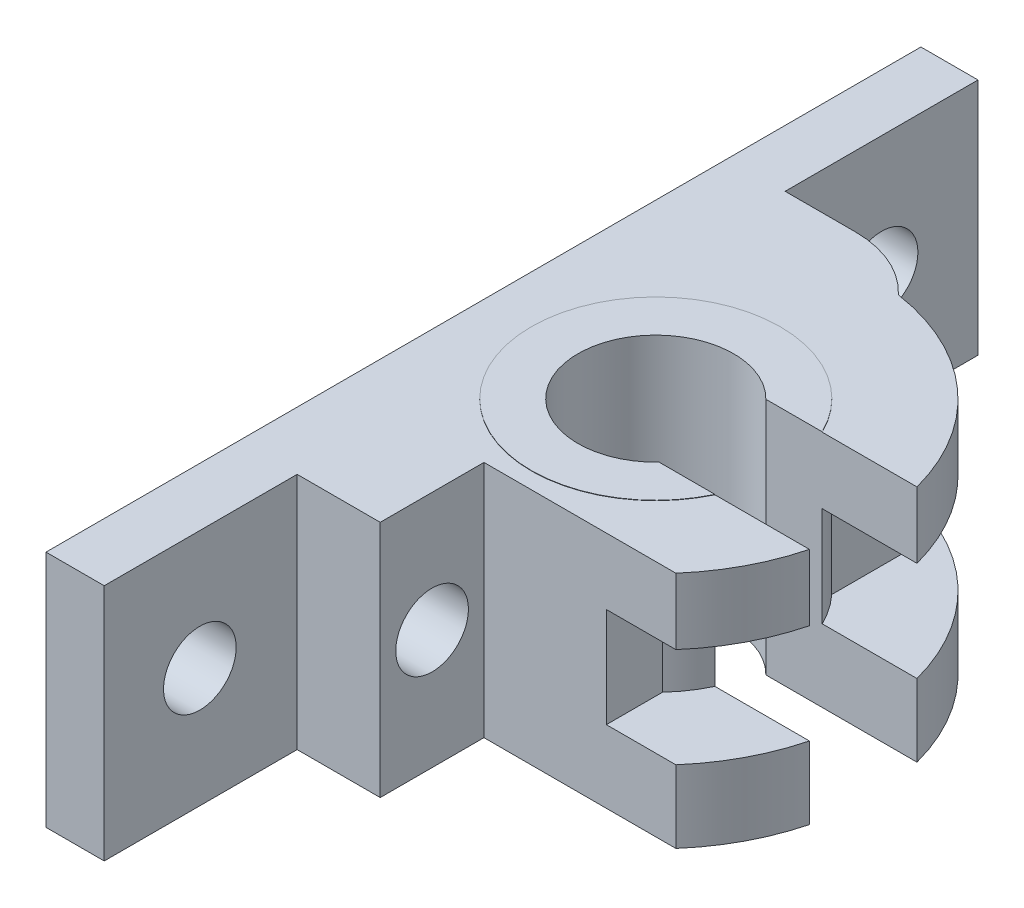
ISO-10303-21;
HEADER;
FILE_DESCRIPTION(('STEP AP214'),'2;1');
FILE_NAME('part.step','',(''),(''),'','','');
FILE_SCHEMA(('AUTOMOTIVE_DESIGN { 1 0 10303 214 1 1 1 1 }'));
ENDSEC;
DATA;
#1=APPLICATION_CONTEXT('core data for automotive mechanical design processes');
#2=APPLICATION_PROTOCOL_DEFINITION('international standard','automotive_design',2000,#1);
#3=PRODUCT_CONTEXT('',#1,'mechanical');
#4=PRODUCT('Part','Part','',(#3));
#5=PRODUCT_RELATED_PRODUCT_CATEGORY('part','',(#4));
#6=PRODUCT_DEFINITION_FORMATION('','',#4);
#7=PRODUCT_DEFINITION_CONTEXT('part definition',#1,'design');
#8=PRODUCT_DEFINITION('design','',#6,#7);
#9=PRODUCT_DEFINITION_SHAPE('','',#8);
#10=(LENGTH_UNIT() NAMED_UNIT(*) SI_UNIT(.MILLI.,.METRE.));
#11=(NAMED_UNIT(*) PLANE_ANGLE_UNIT() SI_UNIT($,.RADIAN.));
#12=(NAMED_UNIT(*) SI_UNIT($,.STERADIAN.) SOLID_ANGLE_UNIT());
#13=UNCERTAINTY_MEASURE_WITH_UNIT(LENGTH_MEASURE(1.E-05),#10,'distance_accuracy_value','');
#14=(GEOMETRIC_REPRESENTATION_CONTEXT(3) GLOBAL_UNCERTAINTY_ASSIGNED_CONTEXT((#13)) GLOBAL_UNIT_ASSIGNED_CONTEXT((#10,
#11,#12)) REPRESENTATION_CONTEXT('',''));
#15=CARTESIAN_POINT('',(0.,0.,0.));
#16=DIRECTION('',(0.,0.,1.));
#17=DIRECTION('',(1.,0.,0.));
#18=AXIS2_PLACEMENT_3D('',#15,#16,#17);
#19=CARTESIAN_POINT('',(0.,11.215,0.));
#20=DIRECTION('',(0.,-1.,0.));
#21=DIRECTION('',(0.,0.,-1.));
#22=AXIS2_PLACEMENT_3D('',#19,#20,#21);
#23=CYLINDRICAL_SURFACE('',#22,11.995);
#24=DIRECTION('',(0.,-1.,0.));
#25=VECTOR('',#24,1.);
#26=CARTESIAN_POINT('',(10.7851270090818,11.215,-5.24986289325488));
#27=LINE('',#26,#25);
#28=CARTESIAN_POINT('',(10.7851270090818,-4.80402203282775,-5.24986289325488));
#29=VERTEX_POINT('',#28);
#30=CARTESIAN_POINT('',(10.7851270090818,4.80402203282774,-5.24986289325488));
#31=VERTEX_POINT('',#30);
#32=EDGE_CURVE('E513',#29,#31,#27,.F.);
#33=ORIENTED_EDGE('',*,*,#32,.F.);
#34=CARTESIAN_POINT('',(0.,-4.80402203282775,0.));
#35=DIRECTION('',(0.,-1.,0.));
#36=DIRECTION('',(0.,0.,-1.));
#37=AXIS2_PLACEMENT_3D('',#34,#35,#36);
#38=CIRCLE('',#37,11.995);
#39=CARTESIAN_POINT('',(8.80000000000003,-4.80402203282775,-8.15107508246609));
#40=VERTEX_POINT('',#39);
#41=EDGE_CURVE('E516',#40,#29,#38,.T.);
#42=ORIENTED_EDGE('',*,*,#41,.F.);
#43=DIRECTION('',(0.,-1.,0.));
#44=VECTOR('',#43,1.);
#45=CARTESIAN_POINT('',(8.80000000000003,11.215,-8.15107508246609));
#46=LINE('',#45,#44);
#47=CARTESIAN_POINT('',(8.80000000000003,4.80402203282774,-8.15107508246609));
#48=VERTEX_POINT('',#47);
#49=EDGE_CURVE('E501',#40,#48,#46,.F.);
#50=ORIENTED_EDGE('',*,*,#49,.T.);
#51=CARTESIAN_POINT('',(0.,4.80402203282774,0.));
#52=DIRECTION('',(0.,1.,0.));
#53=DIRECTION('',(0.,0.,1.));
#54=AXIS2_PLACEMENT_3D('',#51,#52,#53);
#55=CIRCLE('',#54,11.995);
#56=EDGE_CURVE('E497',#31,#48,#55,.T.);
#57=ORIENTED_EDGE('',*,*,#56,.F.);
#58=EDGE_LOOP('',(#33,#42,#50,#57));
#59=FACE_BOUND('',#58,.T.);
#60=ADVANCED_FACE('F61',(#59),#23,.T.);
#61=CARTESIAN_POINT('',(10.7851270090818,11.1805911601393,-5.24986289325488));
#62=VERTEX_POINT('',#61);
#63=CARTESIAN_POINT('',(10.7851270090818,11.215,-5.24986289325488));
#64=VERTEX_POINT('',#63);
#65=EDGE_CURVE('E496',#62,#64,#27,.F.);
#66=ORIENTED_EDGE('',*,*,#65,.F.);
#67=CARTESIAN_POINT('',(0.,11.1805911601393,0.));
#68=DIRECTION('',(0.,-1.,0.));
#69=DIRECTION('',(0.,0.,-1.));
#70=AXIS2_PLACEMENT_3D('',#67,#68,#69);
#71=CIRCLE('',#70,11.995);
#72=CARTESIAN_POINT('',(10.8378510565454,11.1805911601393,5.14013710674512));
#73=VERTEX_POINT('',#72);
#74=EDGE_CURVE('E470',#73,#62,#71,.T.);
#75=ORIENTED_EDGE('',*,*,#74,.F.);
#76=DIRECTION('',(0.,-1.,0.));
#77=VECTOR('',#76,1.);
#78=CARTESIAN_POINT('',(10.8378510565454,11.215,5.14013710674512));
#79=LINE('',#78,#77);
#80=CARTESIAN_POINT('',(10.8378510565454,11.215,5.14013710674512));
#81=VERTEX_POINT('',#80);
#82=EDGE_CURVE('E487',#81,#73,#79,.T.);
#83=ORIENTED_EDGE('',*,*,#82,.F.);
#84=CARTESIAN_POINT('',(0.,11.215,0.));
#85=DIRECTION('',(0.,-1.,0.));
#86=DIRECTION('',(1.,0.,0.));
#87=AXIS2_PLACEMENT_3D('',#84,#85,#86);
#88=CIRCLE('',#87,11.995);
#89=EDGE_CURVE('E514',#81,#64,#88,.T.);
#90=ORIENTED_EDGE('',*,*,#89,.T.);
#91=EDGE_LOOP('',(#66,#75,#83,#90));
#92=FACE_BOUND('',#91,.T.);
#93=ADVANCED_FACE('F495',(#92),#23,.T.);
#94=CARTESIAN_POINT('',(0.,-55.2,0.));
#95=DIRECTION('',(0.,1.,0.));
#96=DIRECTION('',(0.,0.,1.));
#97=AXIS2_PLACEMENT_3D('',#94,#95,#96);
#98=CYLINDRICAL_SURFACE('',#97,20.59);
#99=CARTESIAN_POINT('',(0.,4.80402203282774,0.));
#100=DIRECTION('',(0.,1.,0.));
#101=DIRECTION('',(0.,0.,1.));
#102=AXIS2_PLACEMENT_3D('',#99,#100,#101);
#103=CIRCLE('',#102,20.59);
#104=CARTESIAN_POINT('',(15.4936543015627,4.80402203282774,13.560780817625));
#105=VERTEX_POINT('',#104);
#106=CARTESIAN_POINT('',(19.9380814153183,4.80402203282774,5.14013710674512));
#107=VERTEX_POINT('',#106);
#108=EDGE_CURVE('E378',#105,#107,#103,.T.);
#109=ORIENTED_EDGE('',*,*,#108,.T.);
#110=DIRECTION('',(0.,1.,0.));
#111=VECTOR('',#110,1.);
#112=CARTESIAN_POINT('',(19.9380814153183,-55.2,5.14013710674512));
#113=LINE('',#112,#111);
#114=CARTESIAN_POINT('',(19.9380814153183,11.1805911601393,5.14013710674512));
#115=VERTEX_POINT('',#114);
#116=EDGE_CURVE('E253',#107,#115,#113,.T.);
#117=ORIENTED_EDGE('',*,*,#116,.T.);
#118=CARTESIAN_POINT('',(0.,11.1805911601393,0.));
#119=DIRECTION('',(0.,-1.,0.));
#120=DIRECTION('',(0.,0.,-1.));
#121=AXIS2_PLACEMENT_3D('',#118,#119,#120);
#122=CIRCLE('',#121,20.59);
#123=CARTESIAN_POINT('',(15.4936543015627,11.1805911601393,13.560780817625));
#124=VERTEX_POINT('',#123);
#125=EDGE_CURVE('E361',#115,#124,#122,.T.);
#126=ORIENTED_EDGE('',*,*,#125,.T.);
#127=DIRECTION('',(0.,1.,0.));
#128=VECTOR('',#127,1.);
#129=CARTESIAN_POINT('',(15.4936543015627,-55.2,13.560780817625));
#130=LINE('',#129,#128);
#131=EDGE_CURVE('E323',#124,#105,#130,.F.);
#132=ORIENTED_EDGE('',*,*,#131,.T.);
#133=EDGE_LOOP('',(#109,#117,#126,#132));
#134=FACE_BOUND('',#133,.T.);
#135=ADVANCED_FACE('F418',(#134),#98,.T.);
#136=CARTESIAN_POINT('',(3.00000000000002,11.1805911601393,-20.3702749122343));
#137=VERTEX_POINT('',#136);
#138=CARTESIAN_POINT('',(19.9094711030209,11.1805911601393,-5.24986289325488));
#139=VERTEX_POINT('',#138);
#140=EDGE_CURVE('E358',#137,#139,#122,.T.);
#141=ORIENTED_EDGE('',*,*,#140,.T.);
#142=DIRECTION('',(0.,1.,0.));
#143=VECTOR('',#142,1.);
#144=CARTESIAN_POINT('',(19.9094711030209,-55.2,-5.24986289325488));
#145=LINE('',#144,#143);
#146=CARTESIAN_POINT('',(19.9094711030209,4.80402203282774,-5.24986289325488));
#147=VERTEX_POINT('',#146);
#148=EDGE_CURVE('E257',#139,#147,#145,.F.);
#149=ORIENTED_EDGE('',*,*,#148,.T.);
#150=CARTESIAN_POINT('',(8.80000000000003,4.80402203282774,-18.6147280399151));
#151=VERTEX_POINT('',#150);
#152=EDGE_CURVE('E381',#147,#151,#103,.T.);
#153=ORIENTED_EDGE('',*,*,#152,.T.);
#154=DIRECTION('',(0.,1.,0.));
#155=VECTOR('',#154,1.);
#156=CARTESIAN_POINT('',(8.80000000000003,-55.2,-18.614728039915));
#157=LINE('',#156,#155);
#158=CARTESIAN_POINT('',(8.80000000000003,-4.80402203282774,-18.614728039915));
#159=VERTEX_POINT('',#158);
#160=EDGE_CURVE('E347',#159,#151,#157,.T.);
#161=ORIENTED_EDGE('',*,*,#160,.F.);
#162=CARTESIAN_POINT('',(0.,-4.80402203282775,0.));
#163=DIRECTION('',(0.,-1.,0.));
#164=DIRECTION('',(0.,0.,-1.));
#165=AXIS2_PLACEMENT_3D('',#162,#163,#164);
#166=CIRCLE('',#165,20.59);
#167=CARTESIAN_POINT('',(19.9094711030209,-4.80402203282776,-5.24986289325488));
#168=VERTEX_POINT('',#167);
#169=EDGE_CURVE('E366',#159,#168,#166,.T.);
#170=ORIENTED_EDGE('',*,*,#169,.T.);
#171=CARTESIAN_POINT('',(19.9094711030209,-11.785,-5.24986289325488));
#172=VERTEX_POINT('',#171);
#173=EDGE_CURVE('E252',#168,#172,#145,.F.);
#174=ORIENTED_EDGE('',*,*,#173,.T.);
#175=CARTESIAN_POINT('',(0.,-11.785,0.));
#176=DIRECTION('',(0.,1.,0.));
#177=DIRECTION('',(0.,0.,1.));
#178=AXIS2_PLACEMENT_3D('',#175,#176,#177);
#179=CIRCLE('',#178,20.59);
#180=CARTESIAN_POINT('',(3.00000000000002,-11.785,-20.3702749122342));
#181=VERTEX_POINT('',#180);
#182=EDGE_CURVE('E251',#172,#181,#179,.T.);
#183=ORIENTED_EDGE('',*,*,#182,.T.);
#184=DIRECTION('',(0.,1.,0.));
#185=VECTOR('',#184,1.);
#186=CARTESIAN_POINT('',(3.00000000000003,-55.2,-20.3702749122342));
#187=LINE('',#186,#185);
#188=EDGE_CURVE('E365',#181,#137,#187,.T.);
#189=ORIENTED_EDGE('',*,*,#188,.T.);
#190=EDGE_LOOP('',(#141,#149,#153,#161,#170,#174,#183,#189));
#191=FACE_BOUND('',#190,.T.);
#192=ADVANCED_FACE('F465',(#191),#98,.T.);
#193=CARTESIAN_POINT('',(8.80000000000003,4.80402203282774,22.440347469412));
#194=DIRECTION('',(0.,1.,0.));
#195=DIRECTION('',(0.,0.,1.));
#196=AXIS2_PLACEMENT_3D('',#193,#194,#195);
#197=PLANE('',#196);
#198=DIRECTION('',(-1.,0.,0.));
#199=VECTOR('',#198,1.);
#200=CARTESIAN_POINT('',(8.80000000000003,4.80402203282774,-5.24986289325488));
#201=LINE('',#200,#199);
#202=EDGE_CURVE('E264',#147,#31,#201,.T.);
#203=ORIENTED_EDGE('',*,*,#202,.T.);
#204=ORIENTED_EDGE('',*,*,#56,.T.);
#205=DIRECTION('',(0.,0.,1.));
#206=VECTOR('',#205,1.);
#207=CARTESIAN_POINT('',(8.80000000000003,4.80402203282774,22.440347469412));
#208=LINE('',#207,#206);
#209=EDGE_CURVE('E372',#151,#48,#208,.T.);
#210=ORIENTED_EDGE('',*,*,#209,.F.);
#211=ORIENTED_EDGE('',*,*,#152,.F.);
#212=EDGE_LOOP('',(#203,#204,#210,#211));
#213=FACE_BOUND('',#212,.T.);
#214=ADVANCED_FACE('F526',(#213),#197,.F.);
#215=CARTESIAN_POINT('',(8.80000000000003,-4.80402203282774,22.440347469412));
#216=DIRECTION('',(0.,-1.,0.));
#217=DIRECTION('',(0.,0.,-1.));
#218=AXIS2_PLACEMENT_3D('',#215,#216,#217);
#219=PLANE('',#218);
#220=DIRECTION('',(0.,0.,-1.));
#221=VECTOR('',#220,1.);
#222=CARTESIAN_POINT('',(8.80000000000003,-4.80402203282774,22.440347469412));
#223=LINE('',#222,#221);
#224=EDGE_CURVE('E373',#40,#159,#223,.T.);
#225=ORIENTED_EDGE('',*,*,#224,.F.);
#226=ORIENTED_EDGE('',*,*,#41,.T.);
#227=DIRECTION('',(1.,0.,0.));
#228=VECTOR('',#227,1.);
#229=CARTESIAN_POINT('',(8.80000000000003,-4.80402203282774,-5.24986289325488));
#230=LINE('',#229,#228);
#231=EDGE_CURVE('E255',#29,#168,#230,.T.);
#232=ORIENTED_EDGE('',*,*,#231,.T.);
#233=ORIENTED_EDGE('',*,*,#169,.F.);
#234=EDGE_LOOP('',(#225,#226,#232,#233));
#235=FACE_BOUND('',#234,.T.);
#236=ADVANCED_FACE('F534',(#235),#219,.F.);
#237=CARTESIAN_POINT('',(15.4936543015627,-11.785,13.560780817625));
#238=VERTEX_POINT('',#237);
#239=CARTESIAN_POINT('',(19.9380814153183,-11.785,5.14013710674511));
#240=VERTEX_POINT('',#239);
#241=EDGE_CURVE('E362',#238,#240,#179,.T.);
#242=ORIENTED_EDGE('',*,*,#241,.T.);
#243=DIRECTION('',(0.,1.,0.));
#244=VECTOR('',#243,1.);
#245=CARTESIAN_POINT('',(19.9380814153183,-55.2,5.14013710674512));
#246=LINE('',#245,#244);
#247=CARTESIAN_POINT('',(19.9380814153183,-4.80402203282775,5.14013710674512));
#248=VERTEX_POINT('',#247);
#249=EDGE_CURVE('E474',#240,#248,#246,.T.);
#250=ORIENTED_EDGE('',*,*,#249,.T.);
#251=CARTESIAN_POINT('',(15.4936543015627,-4.80402203282775,13.560780817625));
#252=VERTEX_POINT('',#251);
#253=EDGE_CURVE('E369',#248,#252,#166,.T.);
#254=ORIENTED_EDGE('',*,*,#253,.T.);
#255=EDGE_CURVE('E320',#252,#238,#130,.F.);
#256=ORIENTED_EDGE('',*,*,#255,.T.);
#257=EDGE_LOOP('',(#242,#250,#254,#256));
#258=FACE_BOUND('',#257,.T.);
#259=ADVANCED_FACE('F536',(#258),#98,.T.);
#260=CARTESIAN_POINT('',(-16.2413436660295,11.1805911601393,-36.1));
#261=DIRECTION('',(0.,-1.,0.));
#262=DIRECTION('',(0.,0.,-1.));
#263=AXIS2_PLACEMENT_3D('',#260,#261,#262);
#264=PLANE('',#263);
#265=DIRECTION('',(1.,0.,0.));
#266=VECTOR('',#265,1.);
#267=CARTESIAN_POINT('',(28.4162802638975,11.1805911601393,5.14013710674512));
#268=LINE('',#267,#266);
#269=EDGE_CURVE('E423',#73,#115,#268,.T.);
#270=ORIENTED_EDGE('',*,*,#269,.F.);
#271=ORIENTED_EDGE('',*,*,#74,.T.);
#272=DIRECTION('',(-1.,0.,0.));
#273=VECTOR('',#272,1.);
#274=CARTESIAN_POINT('',(28.4162802638975,11.1805911601393,-5.24986289325488));
#275=LINE('',#274,#273);
#276=EDGE_CURVE('E468',#139,#62,#275,.T.);
#277=ORIENTED_EDGE('',*,*,#276,.F.);
#278=ORIENTED_EDGE('',*,*,#140,.F.);
#279=CARTESIAN_POINT('',(-4.32210177975512,11.1805911601393,-13.5594874741397));
#280=DIRECTION('',(0.,-1.,0.));
#281=DIRECTION('',(0.,0.,-1.));
#282=AXIS2_PLACEMENT_3D('',#279,#280,#281);
#283=CIRCLE('',#282,10.);
#284=CARTESIAN_POINT('',(-4.32210177975512,11.1805911601393,-23.5594874741397));
#285=VERTEX_POINT('',#284);
#286=EDGE_CURVE('E344',#137,#285,#283,.F.);
#287=ORIENTED_EDGE('',*,*,#286,.T.);
#288=DIRECTION('',(1.,0.,0.));
#289=VECTOR('',#288,1.);
#290=CARTESIAN_POINT('',(-16.1,11.1805911601393,-23.5594874741397));
#291=LINE('',#290,#289);
#292=CARTESIAN_POINT('',(-11.1,11.1805911601393,-23.5594874741397));
#293=VERTEX_POINT('',#292);
#294=EDGE_CURVE('E352',#293,#285,#291,.T.);
#295=ORIENTED_EDGE('',*,*,#294,.F.);
#296=DIRECTION('',(0.,0.,-1.));
#297=VECTOR('',#296,1.);
#298=CARTESIAN_POINT('',(-11.1,11.1805911601393,-42.1394874741397));
#299=LINE('',#298,#297);
#300=CARTESIAN_POINT('',(-11.1,11.1805911601393,-42.1394874741397));
#301=VERTEX_POINT('',#300);
#302=EDGE_CURVE('E83',#293,#301,#299,.T.);
#303=ORIENTED_EDGE('',*,*,#302,.T.);
#304=DIRECTION('',(-1.,0.,0.));
#305=VECTOR('',#304,1.);
#306=CARTESIAN_POINT('',(-14.6,11.1805911601393,-42.1394874741397));
#307=LINE('',#306,#305);
#308=CARTESIAN_POINT('',(-16.6,11.1805911601393,-42.1394874741397));
#309=VERTEX_POINT('',#308);
#310=EDGE_CURVE('E391',#301,#309,#307,.T.);
#311=ORIENTED_EDGE('',*,*,#310,.T.);
#312=DIRECTION('',(0.,0.,-1.));
#313=VECTOR('',#312,1.);
#314=CARTESIAN_POINT('',(-16.6,11.1805911601393,-42.1394874741397));
#315=LINE('',#314,#313);
#316=CARTESIAN_POINT('',(-16.6,11.1805911601393,42.140780817625));
#317=VERTEX_POINT('',#316);
#318=EDGE_CURVE('E332',#317,#309,#315,.T.);
#319=ORIENTED_EDGE('',*,*,#318,.F.);
#320=DIRECTION('',(1.,0.,0.));
#321=VECTOR('',#320,1.);
#322=CARTESIAN_POINT('',(-16.2413436660295,11.1805911601393,42.140780817625));
#323=LINE('',#322,#321);
#324=CARTESIAN_POINT('',(-10.9914881303953,11.1805911601393,42.140780817625));
#325=VERTEX_POINT('',#324);
#326=EDGE_CURVE('E357',#317,#325,#323,.T.);
#327=ORIENTED_EDGE('',*,*,#326,.T.);
#328=DIRECTION('',(0.,0.,1.));
#329=VECTOR('',#328,1.);
#330=CARTESIAN_POINT('',(-10.9914881303953,11.1805911601393,23.5554043331375));
#331=LINE('',#330,#329);
#332=CARTESIAN_POINT('',(-10.9914881303953,11.1805911601393,23.5554043331375));
#333=VERTEX_POINT('',#332);
#334=EDGE_CURVE('E295',#333,#325,#331,.T.);
#335=ORIENTED_EDGE('',*,*,#334,.F.);
#336=DIRECTION('',(-1.,0.,0.));
#337=VECTOR('',#336,1.);
#338=CARTESIAN_POINT('',(-10.9914881303953,11.1805911601393,23.5554043331375));
#339=LINE('',#338,#337);
#340=CARTESIAN_POINT('',(-2.98989353262259,11.1805911601393,23.5554043331375));
#341=VERTEX_POINT('',#340);
#342=EDGE_CURVE('E297',#341,#333,#339,.T.);
#343=ORIENTED_EDGE('',*,*,#342,.F.);
#344=DIRECTION('',(0.,0.,1.));
#345=VECTOR('',#344,1.);
#346=CARTESIAN_POINT('',(-2.9898935326226,11.1805911601393,13.560780817625));
#347=LINE('',#346,#345);
#348=CARTESIAN_POINT('',(-2.9898935326226,11.1805911601393,13.560780817625));
#349=VERTEX_POINT('',#348);
#350=EDGE_CURVE('E282',#349,#341,#347,.T.);
#351=ORIENTED_EDGE('',*,*,#350,.F.);
#352=DIRECTION('',(-1.,0.,0.));
#353=VECTOR('',#352,1.);
#354=CARTESIAN_POINT('',(-4.2298935326226,11.1805911601393,13.560780817625));
#355=LINE('',#354,#353);
#356=EDGE_CURVE('E310',#124,#349,#355,.T.);
#357=ORIENTED_EDGE('',*,*,#356,.F.);
#358=ORIENTED_EDGE('',*,*,#125,.F.);
#359=EDGE_LOOP('',(#270,#271,#277,#278,#287,#295,#303,#311,#319,#327,#335,#343,#351,#357,#358));
#360=FACE_BOUND('',#359,.T.);
#361=ADVANCED_FACE('F63',(#360),#264,.F.);
#362=CARTESIAN_POINT('',(-1.39148813039528,-11.785,-34.2));
#363=DIRECTION('',(0.,1.,0.));
#364=DIRECTION('',(0.,0.,1.));
#365=AXIS2_PLACEMENT_3D('',#362,#363,#364);
#366=PLANE('',#365);
#367=DIRECTION('',(-1.,0.,0.));
#368=VECTOR('',#367,1.);
#369=CARTESIAN_POINT('',(-1.39148813039528,-11.785,-5.24986289325488));
#370=LINE('',#369,#368);
#371=CARTESIAN_POINT('',(5.35620570945754,-11.785,-5.24986289325488));
#372=VERTEX_POINT('',#371);
#373=EDGE_CURVE('E243',#172,#372,#370,.T.);
#374=ORIENTED_EDGE('',*,*,#373,.T.);
#375=CARTESIAN_POINT('',(0.,-11.785,0.));
#376=DIRECTION('',(0.,-1.,0.));
#377=DIRECTION('',(0.,0.,-1.));
#378=AXIS2_PLACEMENT_3D('',#375,#376,#377);
#379=CIRCLE('',#378,7.5);
#380=CARTESIAN_POINT('',(5.461592306632,-11.785,5.14013710674512));
#381=VERTEX_POINT('',#380);
#382=EDGE_CURVE('E231',#381,#372,#379,.T.);
#383=ORIENTED_EDGE('',*,*,#382,.F.);
#384=DIRECTION('',(1.,0.,0.));
#385=VECTOR('',#384,1.);
#386=CARTESIAN_POINT('',(-1.39148813039527,-11.785,5.14013710674512));
#387=LINE('',#386,#385);
#388=EDGE_CURVE('E472',#381,#240,#387,.T.);
#389=ORIENTED_EDGE('',*,*,#388,.T.);
#390=ORIENTED_EDGE('',*,*,#241,.F.);
#391=DIRECTION('',(-1.,0.,0.));
#392=VECTOR('',#391,1.);
#393=CARTESIAN_POINT('',(-4.2298935326226,-11.785,13.560780817625));
#394=LINE('',#393,#392);
#395=CARTESIAN_POINT('',(-2.9898935326226,-11.785,13.560780817625));
#396=VERTEX_POINT('',#395);
#397=EDGE_CURVE('E311',#238,#396,#394,.T.);
#398=ORIENTED_EDGE('',*,*,#397,.T.);
#399=DIRECTION('',(0.,0.,1.));
#400=VECTOR('',#399,1.);
#401=CARTESIAN_POINT('',(-2.9898935326226,-11.785,-34.2));
#402=LINE('',#401,#400);
#403=CARTESIAN_POINT('',(-2.98989353262259,-11.785,23.5554043331375));
#404=VERTEX_POINT('',#403);
#405=EDGE_CURVE('E290',#396,#404,#402,.T.);
#406=ORIENTED_EDGE('',*,*,#405,.T.);
#407=DIRECTION('',(-1.,0.,0.));
#408=VECTOR('',#407,1.);
#409=CARTESIAN_POINT('',(-1.39148813039528,-11.785,23.5554043331375));
#410=LINE('',#409,#408);
#411=CARTESIAN_POINT('',(-10.9914881303953,-11.785,23.5554043331375));
#412=VERTEX_POINT('',#411);
#413=EDGE_CURVE('E303',#404,#412,#410,.T.);
#414=ORIENTED_EDGE('',*,*,#413,.T.);
#415=DIRECTION('',(0.,0.,1.));
#416=VECTOR('',#415,1.);
#417=CARTESIAN_POINT('',(-10.9914881303953,-11.785,-34.2));
#418=LINE('',#417,#416);
#419=CARTESIAN_POINT('',(-10.9914881303953,-11.785,42.140780817625));
#420=VERTEX_POINT('',#419);
#421=EDGE_CURVE('E307',#412,#420,#418,.T.);
#422=ORIENTED_EDGE('',*,*,#421,.T.);
#423=DIRECTION('',(1.,0.,0.));
#424=VECTOR('',#423,1.);
#425=CARTESIAN_POINT('',(-10.9914881303953,-11.785,42.140780817625));
#426=LINE('',#425,#424);
#427=CARTESIAN_POINT('',(-16.6,-11.785,42.140780817625));
#428=VERTEX_POINT('',#427);
#429=EDGE_CURVE('E341',#428,#420,#426,.T.);
#430=ORIENTED_EDGE('',*,*,#429,.F.);
#431=DIRECTION('',(0.,0.,1.));
#432=VECTOR('',#431,1.);
#433=CARTESIAN_POINT('',(-16.6,-11.785,-42.1394874741397));
#434=LINE('',#433,#432);
#435=CARTESIAN_POINT('',(-16.6,-11.785,-42.1394874741397));
#436=VERTEX_POINT('',#435);
#437=EDGE_CURVE('E330',#436,#428,#434,.T.);
#438=ORIENTED_EDGE('',*,*,#437,.F.);
#439=DIRECTION('',(1.,0.,0.));
#440=VECTOR('',#439,1.);
#441=CARTESIAN_POINT('',(-14.6,-11.785,-42.1394874741397));
#442=LINE('',#441,#440);
#443=CARTESIAN_POINT('',(-11.1,-11.785,-42.1394874741397));
#444=VERTEX_POINT('',#443);
#445=EDGE_CURVE('E336',#436,#444,#442,.T.);
#446=ORIENTED_EDGE('',*,*,#445,.T.);
#447=DIRECTION('',(0.,0.,1.));
#448=VECTOR('',#447,1.);
#449=CARTESIAN_POINT('',(-11.1,-11.785,-36.510780817625));
#450=LINE('',#449,#448);
#451=CARTESIAN_POINT('',(-11.1,-11.785,-23.5594874741397));
#452=VERTEX_POINT('',#451);
#453=EDGE_CURVE('E348',#444,#452,#450,.T.);
#454=ORIENTED_EDGE('',*,*,#453,.T.);
#455=DIRECTION('',(-1.,0.,0.));
#456=VECTOR('',#455,1.);
#457=CARTESIAN_POINT('',(3.00000000000002,-11.785,-23.5594874741397));
#458=LINE('',#457,#456);
#459=CARTESIAN_POINT('',(-4.32210177975512,-11.785,-23.5594874741397));
#460=VERTEX_POINT('',#459);
#461=EDGE_CURVE('E351',#460,#452,#458,.T.);
#462=ORIENTED_EDGE('',*,*,#461,.F.);
#463=CARTESIAN_POINT('',(-4.32210177975512,-11.785,-13.5594874741397));
#464=DIRECTION('',(0.,1.,0.));
#465=DIRECTION('',(0.,0.,1.));
#466=AXIS2_PLACEMENT_3D('',#463,#464,#465);
#467=CIRCLE('',#466,10.);
#468=EDGE_CURVE('E345',#460,#181,#467,.F.);
#469=ORIENTED_EDGE('',*,*,#468,.T.);
#470=ORIENTED_EDGE('',*,*,#182,.F.);
#471=EDGE_LOOP('',(#374,#383,#389,#390,#398,#406,#414,#422,#430,#438,#446,#454,#462,#469,#470));
#472=FACE_BOUND('',#471,.T.);
#473=ADVANCED_FACE('F249',(#472),#366,.F.);
#474=CARTESIAN_POINT('',(8.80000000000003,4.80402203282774,8.15107508246609));
#475=VERTEX_POINT('',#474);
#476=CARTESIAN_POINT('',(8.80000000000003,4.80402203282774,13.560780817625));
#477=VERTEX_POINT('',#476);
#478=EDGE_CURVE('E375',#475,#477,#208,.T.);
#479=ORIENTED_EDGE('',*,*,#478,.F.);
#480=CARTESIAN_POINT('',(0.,4.80402203282774,0.));
#481=DIRECTION('',(0.,1.,0.));
#482=DIRECTION('',(0.,0.,1.));
#483=AXIS2_PLACEMENT_3D('',#480,#481,#482);
#484=CIRCLE('',#483,11.995);
#485=CARTESIAN_POINT('',(10.8378510565454,4.80402203282774,5.14013710674512));
#486=VERTEX_POINT('',#485);
#487=EDGE_CURVE('E411',#475,#486,#484,.T.);
#488=ORIENTED_EDGE('',*,*,#487,.T.);
#489=DIRECTION('',(1.,0.,0.));
#490=VECTOR('',#489,1.);
#491=CARTESIAN_POINT('',(8.80000000000003,4.80402203282774,5.14013710674512));
#492=LINE('',#491,#490);
#493=EDGE_CURVE('E259',#486,#107,#492,.T.);
#494=ORIENTED_EDGE('',*,*,#493,.T.);
#495=ORIENTED_EDGE('',*,*,#108,.F.);
#496=DIRECTION('',(-1.,0.,0.));
#497=VECTOR('',#496,1.);
#498=CARTESIAN_POINT('',(8.80000000000003,4.80402203282774,13.560780817625));
#499=LINE('',#498,#497);
#500=EDGE_CURVE('E317',#105,#477,#499,.T.);
#501=ORIENTED_EDGE('',*,*,#500,.T.);
#502=EDGE_LOOP('',(#479,#488,#494,#495,#501));
#503=FACE_BOUND('',#502,.T.);
#504=ADVANCED_FACE('F410',(#503),#197,.F.);
#505=CARTESIAN_POINT('',(8.80000000000003,0.,0.));
#506=DIRECTION('',(1.,0.,0.));
#507=DIRECTION('',(0.,0.,-1.));
#508=AXIS2_PLACEMENT_3D('',#505,#506,#507);
#509=PLANE('',#508);
#510=ORIENTED_EDGE('',*,*,#49,.F.);
#511=ORIENTED_EDGE('',*,*,#224,.T.);
#512=ORIENTED_EDGE('',*,*,#160,.T.);
#513=ORIENTED_EDGE('',*,*,#209,.T.);
#514=EDGE_LOOP('',(#510,#511,#512,#513));
#515=FACE_BOUND('',#514,.T.);
#516=ADVANCED_FACE('F529',(#515),#509,.T.);
#517=DIRECTION('',(0.,-1.,0.));
#518=VECTOR('',#517,1.);
#519=CARTESIAN_POINT('',(8.80000000000003,11.215,8.15107508246609));
#520=LINE('',#519,#518);
#521=CARTESIAN_POINT('',(8.80000000000003,-4.80402203282774,8.15107508246609));
#522=VERTEX_POINT('',#521);
#523=EDGE_CURVE('E407',#475,#522,#520,.T.);
#524=ORIENTED_EDGE('',*,*,#523,.F.);
#525=ORIENTED_EDGE('',*,*,#478,.T.);
#526=DIRECTION('',(0.,1.,0.));
#527=VECTOR('',#526,1.);
#528=CARTESIAN_POINT('',(8.80000000000003,0.,13.560780817625));
#529=LINE('',#528,#527);
#530=CARTESIAN_POINT('',(8.80000000000003,-4.80402203282774,13.560780817625));
#531=VERTEX_POINT('',#530);
#532=EDGE_CURVE('E313',#531,#477,#529,.T.);
#533=ORIENTED_EDGE('',*,*,#532,.F.);
#534=EDGE_CURVE('E376',#531,#522,#223,.T.);
#535=ORIENTED_EDGE('',*,*,#534,.T.);
#536=EDGE_LOOP('',(#524,#525,#533,#535));
#537=FACE_BOUND('',#536,.T.);
#538=ADVANCED_FACE('F405',(#537),#509,.T.);
#539=DIRECTION('',(-1.,0.,0.));
#540=VECTOR('',#539,1.);
#541=CARTESIAN_POINT('',(8.80000000000003,-4.80402203282774,5.14013710674512));
#542=LINE('',#541,#540);
#543=CARTESIAN_POINT('',(10.8378510565454,-4.80402203282775,5.14013710674512));
#544=VERTEX_POINT('',#543);
#545=EDGE_CURVE('E482',#248,#544,#542,.T.);
#546=ORIENTED_EDGE('',*,*,#545,.T.);
#547=CARTESIAN_POINT('',(0.,-4.80402203282775,0.));
#548=DIRECTION('',(0.,-1.,0.));
#549=DIRECTION('',(0.,0.,-1.));
#550=AXIS2_PLACEMENT_3D('',#547,#548,#549);
#551=CIRCLE('',#550,11.995);
#552=EDGE_CURVE('E476',#544,#522,#551,.T.);
#553=ORIENTED_EDGE('',*,*,#552,.T.);
#554=ORIENTED_EDGE('',*,*,#534,.F.);
#555=DIRECTION('',(1.,0.,0.));
#556=VECTOR('',#555,1.);
#557=CARTESIAN_POINT('',(8.80000000000003,-4.80402203282774,13.560780817625));
#558=LINE('',#557,#556);
#559=EDGE_CURVE('E69',#531,#252,#558,.T.);
#560=ORIENTED_EDGE('',*,*,#559,.T.);
#561=ORIENTED_EDGE('',*,*,#253,.F.);
#562=EDGE_LOOP('',(#546,#553,#554,#560,#561));
#563=FACE_BOUND('',#562,.T.);
#564=ADVANCED_FACE('F396',(#563),#219,.F.);
#565=CARTESIAN_POINT('',(3.00000000000002,-11.785,-23.5594874741397));
#566=DIRECTION('',(0.,0.,1.));
#567=DIRECTION('',(1.,0.,0.));
#568=AXIS2_PLACEMENT_3D('',#565,#566,#567);
#569=PLANE('',#568);
#570=ORIENTED_EDGE('',*,*,#294,.T.);
#571=DIRECTION('',(0.,1.,0.));
#572=VECTOR('',#571,1.);
#573=CARTESIAN_POINT('',(-4.32210177975512,-11.785,-23.5594874741397));
#574=LINE('',#573,#572);
#575=EDGE_CURVE('E349',#285,#460,#574,.F.);
#576=ORIENTED_EDGE('',*,*,#575,.T.);
#577=ORIENTED_EDGE('',*,*,#461,.T.);
#578=DIRECTION('',(0.,1.,0.));
#579=VECTOR('',#578,1.);
#580=CARTESIAN_POINT('',(-11.1,-11.785,-23.5594874741397));
#581=LINE('',#580,#579);
#582=EDGE_CURVE('E354',#452,#293,#581,.T.);
#583=ORIENTED_EDGE('',*,*,#582,.T.);
#584=EDGE_LOOP('',(#570,#576,#577,#583));
#585=FACE_BOUND('',#584,.T.);
#586=ADVANCED_FACE('F457',(#585),#569,.F.);
#587=CARTESIAN_POINT('',(-11.1,11.1805911601393,-36.510780817625));
#588=DIRECTION('',(1.,0.,0.));
#589=DIRECTION('',(0.,0.,-1.));
#590=AXIS2_PLACEMENT_3D('',#587,#588,#589);
#591=PLANE('',#590);
#592=CARTESIAN_POINT('',(-11.1,-0.302204419938334,-32.849487474146));
#593=DIRECTION('',(1.,0.,0.));
#594=DIRECTION('',(0.,0.,-1.));
#595=AXIS2_PLACEMENT_3D('',#592,#593,#594);
#596=CIRCLE('',#595,3.5);
#597=CARTESIAN_POINT('',(-11.1,-0.302204419938334,-36.349487474146));
#598=VERTEX_POINT('',#597);
#599=EDGE_CURVE('E275',#598,#598,#596,.T.);
#600=ORIENTED_EDGE('',*,*,#599,.F.);
#601=EDGE_LOOP('',(#600));
#602=FACE_BOUND('',#601,.T.);
#603=ORIENTED_EDGE('',*,*,#302,.F.);
#604=ORIENTED_EDGE('',*,*,#582,.F.);
#605=ORIENTED_EDGE('',*,*,#453,.F.);
#606=DIRECTION('',(0.,-1.,0.));
#607=VECTOR('',#606,1.);
#608=CARTESIAN_POINT('',(-11.1,11.315,-42.1394874741397));
#609=LINE('',#608,#607);
#610=EDGE_CURVE('E339',#301,#444,#609,.T.);
#611=ORIENTED_EDGE('',*,*,#610,.F.);
#612=EDGE_LOOP('',(#603,#604,#605,#611));
#613=FACE_BOUND('',#612,.T.);
#614=ADVANCED_FACE('F455',(#602,#613),#591,.T.);
#615=CARTESIAN_POINT('',(-4.32210177975512,-55.2,-13.5594874741397));
#616=DIRECTION('',(0.,1.,0.));
#617=DIRECTION('',(0.,0.,1.));
#618=AXIS2_PLACEMENT_3D('',#615,#616,#617);
#619=CYLINDRICAL_SURFACE('',#618,10.);
#620=ORIENTED_EDGE('',*,*,#468,.F.);
#621=ORIENTED_EDGE('',*,*,#575,.F.);
#622=ORIENTED_EDGE('',*,*,#286,.F.);
#623=ORIENTED_EDGE('',*,*,#188,.F.);
#624=EDGE_LOOP('',(#620,#621,#622,#623));
#625=FACE_BOUND('',#624,.T.);
#626=ADVANCED_FACE('F462',(#625),#619,.T.);
#627=CARTESIAN_POINT('',(-10.9914881303953,11.315,42.140780817625));
#628=DIRECTION('',(0.,0.,-1.));
#629=DIRECTION('',(-1.,0.,0.));
#630=AXIS2_PLACEMENT_3D('',#627,#628,#629);
#631=PLANE('',#630);
#632=ORIENTED_EDGE('',*,*,#429,.T.);
#633=DIRECTION('',(0.,1.,0.));
#634=VECTOR('',#633,1.);
#635=CARTESIAN_POINT('',(-10.9914881303953,-12.8194088398607,42.140780817625));
#636=LINE('',#635,#634);
#637=EDGE_CURVE('E299',#420,#325,#636,.T.);
#638=ORIENTED_EDGE('',*,*,#637,.T.);
#639=ORIENTED_EDGE('',*,*,#326,.F.);
#640=DIRECTION('',(0.,1.,0.));
#641=VECTOR('',#640,1.);
#642=CARTESIAN_POINT('',(-16.6,-11.785,42.140780817625));
#643=LINE('',#642,#641);
#644=EDGE_CURVE('E324',#428,#317,#643,.T.);
#645=ORIENTED_EDGE('',*,*,#644,.F.);
#646=EDGE_LOOP('',(#632,#638,#639,#645));
#647=FACE_BOUND('',#646,.T.);
#648=ADVANCED_FACE('F442',(#647),#631,.F.);
#649=CARTESIAN_POINT('',(-14.6,11.315,-42.1394874741397));
#650=DIRECTION('',(0.,0.,-1.));
#651=DIRECTION('',(-1.,0.,0.));
#652=AXIS2_PLACEMENT_3D('',#649,#650,#651);
#653=PLANE('',#652);
#654=ORIENTED_EDGE('',*,*,#310,.F.);
#655=ORIENTED_EDGE('',*,*,#610,.T.);
#656=ORIENTED_EDGE('',*,*,#445,.F.);
#657=DIRECTION('',(0.,-1.,0.));
#658=VECTOR('',#657,1.);
#659=CARTESIAN_POINT('',(-16.6,-11.785,-42.1394874741397));
#660=LINE('',#659,#658);
#661=EDGE_CURVE('E327',#309,#436,#660,.T.);
#662=ORIENTED_EDGE('',*,*,#661,.F.);
#663=EDGE_LOOP('',(#654,#655,#656,#662));
#664=FACE_BOUND('',#663,.T.);
#665=ADVANCED_FACE('F451',(#664),#653,.T.);
#666=CARTESIAN_POINT('',(-16.6,0.,0.));
#667=DIRECTION('',(1.,0.,0.));
#668=DIRECTION('',(0.,0.,-1.));
#669=AXIS2_PLACEMENT_3D('',#666,#667,#668);
#670=PLANE('',#669);
#671=CARTESIAN_POINT('',(-16.6,-0.302204419934331,18.5580925753926));
#672=DIRECTION('',(1.,0.,0.));
#673=DIRECTION('',(0.,0.,-1.));
#674=AXIS2_PLACEMENT_3D('',#671,#672,#673);
#675=CIRCLE('',#674,3.5);
#676=CARTESIAN_POINT('',(-16.6,-0.302204419934331,15.0580925753926));
#677=VERTEX_POINT('',#676);
#678=EDGE_CURVE('E266',#677,#677,#675,.T.);
#679=ORIENTED_EDGE('',*,*,#678,.T.);
#680=EDGE_LOOP('',(#679));
#681=FACE_BOUND('',#680,.T.);
#682=CARTESIAN_POINT('',(-16.6,-0.302204419938334,-32.849487474146));
#683=DIRECTION('',(1.,0.,0.));
#684=DIRECTION('',(0.,0.,-1.));
#685=AXIS2_PLACEMENT_3D('',#682,#683,#684);
#686=CIRCLE('',#685,3.5);
#687=CARTESIAN_POINT('',(-16.6,-0.302204419938334,-36.349487474146));
#688=VERTEX_POINT('',#687);
#689=EDGE_CURVE('E269',#688,#688,#686,.T.);
#690=ORIENTED_EDGE('',*,*,#689,.T.);
#691=EDGE_LOOP('',(#690));
#692=FACE_BOUND('',#691,.T.);
#693=CARTESIAN_POINT('',(-16.6,-0.302204419930327,32.9286686363162));
#694=DIRECTION('',(1.,0.,0.));
#695=DIRECTION('',(0.,0.,-1.));
#696=AXIS2_PLACEMENT_3D('',#693,#694,#695);
#697=CIRCLE('',#696,3.5);
#698=CARTESIAN_POINT('',(-16.6,-0.302204419930327,29.4286686363162));
#699=VERTEX_POINT('',#698);
#700=EDGE_CURVE('E279',#699,#699,#697,.T.);
#701=ORIENTED_EDGE('',*,*,#700,.T.);
#702=EDGE_LOOP('',(#701));
#703=FACE_BOUND('',#702,.T.);
#704=ORIENTED_EDGE('',*,*,#661,.T.);
#705=ORIENTED_EDGE('',*,*,#437,.T.);
#706=ORIENTED_EDGE('',*,*,#644,.T.);
#707=ORIENTED_EDGE('',*,*,#318,.T.);
#708=EDGE_LOOP('',(#704,#705,#706,#707));
#709=FACE_BOUND('',#708,.T.);
#710=ADVANCED_FACE('F444',(#681,#692,#703,#709),#670,.F.);
#711=CARTESIAN_POINT('',(-4.2298935326226,-11.785,13.560780817625));
#712=DIRECTION('',(0.,0.,-1.));
#713=DIRECTION('',(-1.,0.,0.));
#714=AXIS2_PLACEMENT_3D('',#711,#712,#713);
#715=PLANE('',#714);
#716=ORIENTED_EDGE('',*,*,#356,.T.);
#717=DIRECTION('',(0.,1.,0.));
#718=VECTOR('',#717,1.);
#719=CARTESIAN_POINT('',(-2.9898935326226,-21.0594088398607,13.560780817625));
#720=LINE('',#719,#718);
#721=EDGE_CURVE('E286',#396,#349,#720,.T.);
#722=ORIENTED_EDGE('',*,*,#721,.F.);
#723=ORIENTED_EDGE('',*,*,#397,.F.);
#724=ORIENTED_EDGE('',*,*,#255,.F.);
#725=ORIENTED_EDGE('',*,*,#559,.F.);
#726=ORIENTED_EDGE('',*,*,#532,.T.);
#727=ORIENTED_EDGE('',*,*,#500,.F.);
#728=ORIENTED_EDGE('',*,*,#131,.F.);
#729=EDGE_LOOP('',(#716,#722,#723,#724,#725,#726,#727,#728));
#730=FACE_BOUND('',#729,.T.);
#731=ADVANCED_FACE('F402',(#730),#715,.F.);
#732=CARTESIAN_POINT('',(-10.9914881303953,-12.8194088398607,23.5554043331375));
#733=DIRECTION('',(-1.,0.,0.));
#734=DIRECTION('',(0.,0.,1.));
#735=AXIS2_PLACEMENT_3D('',#732,#733,#734);
#736=PLANE('',#735);
#737=CARTESIAN_POINT('',(-10.9914881303953,-0.302204419930327,32.9286686363162));
#738=DIRECTION('',(1.,0.,0.));
#739=DIRECTION('',(0.,0.,-1.));
#740=AXIS2_PLACEMENT_3D('',#737,#738,#739);
#741=CIRCLE('',#740,3.5);
#742=CARTESIAN_POINT('',(-10.9914881303953,-0.302204419930327,29.4286686363162));
#743=VERTEX_POINT('',#742);
#744=EDGE_CURVE('E278',#743,#743,#741,.T.);
#745=ORIENTED_EDGE('',*,*,#744,.F.);
#746=EDGE_LOOP('',(#745));
#747=FACE_BOUND('',#746,.T.);
#748=DIRECTION('',(0.,1.,0.));
#749=VECTOR('',#748,1.);
#750=CARTESIAN_POINT('',(-10.9914881303953,-12.8194088398607,23.5554043331375));
#751=LINE('',#750,#749);
#752=EDGE_CURVE('E300',#412,#333,#751,.T.);
#753=ORIENTED_EDGE('',*,*,#752,.T.);
#754=ORIENTED_EDGE('',*,*,#334,.T.);
#755=ORIENTED_EDGE('',*,*,#637,.F.);
#756=ORIENTED_EDGE('',*,*,#421,.F.);
#757=EDGE_LOOP('',(#753,#754,#755,#756));
#758=FACE_BOUND('',#757,.T.);
#759=ADVANCED_FACE('F438',(#747,#758),#736,.F.);
#760=CARTESIAN_POINT('',(-10.9914881303953,-12.8194088398607,23.5554043331375));
#761=DIRECTION('',(0.,0.,-1.));
#762=DIRECTION('',(-1.,0.,0.));
#763=AXIS2_PLACEMENT_3D('',#760,#761,#762);
#764=PLANE('',#763);
#765=ORIENTED_EDGE('',*,*,#413,.F.);
#766=DIRECTION('',(0.,1.,0.));
#767=VECTOR('',#766,1.);
#768=CARTESIAN_POINT('',(-2.98989353262259,-21.0594088398607,23.5554043331375));
#769=LINE('',#768,#767);
#770=EDGE_CURVE('E287',#404,#341,#769,.T.);
#771=ORIENTED_EDGE('',*,*,#770,.T.);
#772=ORIENTED_EDGE('',*,*,#342,.T.);
#773=ORIENTED_EDGE('',*,*,#752,.F.);
#774=EDGE_LOOP('',(#765,#771,#772,#773));
#775=FACE_BOUND('',#774,.T.);
#776=ADVANCED_FACE('F435',(#775),#764,.F.);
#777=CARTESIAN_POINT('',(-2.9898935326226,-21.0594088398607,13.560780817625));
#778=DIRECTION('',(-1.,0.,0.));
#779=DIRECTION('',(0.,0.,1.));
#780=AXIS2_PLACEMENT_3D('',#777,#778,#779);
#781=PLANE('',#780);
#782=CARTESIAN_POINT('',(-2.9898935326226,-0.302204419934331,18.5580925753926));
#783=DIRECTION('',(1.,0.,0.));
#784=DIRECTION('',(0.,0.,-1.));
#785=AXIS2_PLACEMENT_3D('',#782,#783,#784);
#786=CIRCLE('',#785,3.5);
#787=CARTESIAN_POINT('',(-2.98989353262259,-0.302204419934331,15.0580925753926));
#788=VERTEX_POINT('',#787);
#789=EDGE_CURVE('E270',#788,#788,#786,.T.);
#790=ORIENTED_EDGE('',*,*,#789,.F.);
#791=EDGE_LOOP('',(#790));
#792=FACE_BOUND('',#791,.T.);
#793=ORIENTED_EDGE('',*,*,#721,.T.);
#794=ORIENTED_EDGE('',*,*,#350,.T.);
#795=ORIENTED_EDGE('',*,*,#770,.F.);
#796=ORIENTED_EDGE('',*,*,#405,.F.);
#797=EDGE_LOOP('',(#793,#794,#795,#796));
#798=FACE_BOUND('',#797,.T.);
#799=ADVANCED_FACE('F429',(#792,#798),#781,.F.);
#800=CARTESIAN_POINT('',(-16.6,-0.302204419930327,32.9286686363162));
#801=DIRECTION('',(1.,0.,0.));
#802=DIRECTION('',(0.,0.,-1.));
#803=AXIS2_PLACEMENT_3D('',#800,#801,#802);
#804=CYLINDRICAL_SURFACE('',#803,3.5);
#805=ORIENTED_EDGE('',*,*,#700,.F.);
#806=EDGE_LOOP('',(#805));
#807=FACE_BOUND('',#806,.T.);
#808=ORIENTED_EDGE('',*,*,#744,.T.);
#809=EDGE_LOOP('',(#808));
#810=FACE_BOUND('',#809,.T.);
#811=ADVANCED_FACE('F573',(#807,#810),#804,.F.);
#812=CARTESIAN_POINT('',(-16.6,-0.302204419938334,-32.849487474146));
#813=DIRECTION('',(1.,0.,0.));
#814=DIRECTION('',(0.,0.,-1.));
#815=AXIS2_PLACEMENT_3D('',#812,#813,#814);
#816=CYLINDRICAL_SURFACE('',#815,3.5);
#817=ORIENTED_EDGE('',*,*,#599,.T.);
#818=EDGE_LOOP('',(#817));
#819=FACE_BOUND('',#818,.T.);
#820=ORIENTED_EDGE('',*,*,#689,.F.);
#821=EDGE_LOOP('',(#820));
#822=FACE_BOUND('',#821,.T.);
#823=ADVANCED_FACE('F569',(#819,#822),#816,.F.);
#824=CARTESIAN_POINT('',(-16.6,-0.302204419934331,18.5580925753926));
#825=DIRECTION('',(1.,0.,0.));
#826=DIRECTION('',(0.,0.,-1.));
#827=AXIS2_PLACEMENT_3D('',#824,#825,#826);
#828=CYLINDRICAL_SURFACE('',#827,3.5);
#829=CARTESIAN_POINT('',(-16.6,-0.302204419934331,15.0580925753926));
#830=CARTESIAN_POINT('',(-16.4582280576315,-0.302204419934331,15.0580925753926));
#831=CARTESIAN_POINT('',(-16.316456115263,-0.302204419934331,15.0580925753926));
#832=CARTESIAN_POINT('',(-16.0329122305259,-0.302204419934331,15.0580925753926));
#833=CARTESIAN_POINT('',(-15.8911402881574,-0.302204419934331,15.0580925753926));
#834=CARTESIAN_POINT('',(-15.6075964034204,-0.302204419934331,15.0580925753926));
#835=CARTESIAN_POINT('',(-15.4658244610519,-0.302204419934331,15.0580925753926));
#836=CARTESIAN_POINT('',(-15.1822805763148,-0.302204419934331,15.0580925753926));
#837=CARTESIAN_POINT('',(-15.0405086339463,-0.302204419934331,15.0580925753926));
#838=CARTESIAN_POINT('',(-14.7569647492093,-0.302204419934331,15.0580925753926));
#839=CARTESIAN_POINT('',(-14.6151928068408,-0.302204419934331,15.0580925753926));
#840=CARTESIAN_POINT('',(-14.3316489221038,-0.302204419934331,15.0580925753926));
#841=CARTESIAN_POINT('',(-14.1898769797352,-0.302204419934331,15.0580925753926));
#842=CARTESIAN_POINT('',(-13.9063330949982,-0.302204419934331,15.0580925753926));
#843=CARTESIAN_POINT('',(-13.7645611526297,-0.302204419934331,15.0580925753926));
#844=CARTESIAN_POINT('',(-13.4810172678927,-0.302204419934331,15.0580925753926));
#845=CARTESIAN_POINT('',(-13.3392453255241,-0.302204419934331,15.0580925753926));
#846=CARTESIAN_POINT('',(-13.0557014407871,-0.302204419934331,15.0580925753926));
#847=CARTESIAN_POINT('',(-12.9139294984186,-0.302204419934331,15.0580925753926));
#848=CARTESIAN_POINT('',(-12.6303856136816,-0.302204419934331,15.0580925753926));
#849=CARTESIAN_POINT('',(-12.4886136713131,-0.302204419934331,15.0580925753926));
#850=CARTESIAN_POINT('',(-12.205069786576,-0.302204419934331,15.0580925753926));
#851=CARTESIAN_POINT('',(-12.0632978442075,-0.302204419934331,15.0580925753926));
#852=CARTESIAN_POINT('',(-11.7797539594705,-0.302204419934331,15.0580925753926));
#853=CARTESIAN_POINT('',(-11.637982017102,-0.302204419934331,15.0580925753926));
#854=CARTESIAN_POINT('',(-11.3544381323649,-0.302204419934331,15.0580925753926));
#855=CARTESIAN_POINT('',(-11.2126661899964,-0.302204419934331,15.0580925753926));
#856=CARTESIAN_POINT('',(-10.9291223052594,-0.302204419934331,15.0580925753926));
#857=CARTESIAN_POINT('',(-10.7873503628909,-0.302204419934331,15.0580925753926));
#858=CARTESIAN_POINT('',(-10.5038064781539,-0.302204419934331,15.0580925753926));
#859=CARTESIAN_POINT('',(-10.3620345357853,-0.302204419934331,15.0580925753926));
#860=CARTESIAN_POINT('',(-10.0784906510483,-0.302204419934331,15.0580925753926));
#861=CARTESIAN_POINT('',(-9.93671870867981,-0.302204419934331,15.0580925753926));
#862=CARTESIAN_POINT('',(-9.65317482394277,-0.302204419934331,15.0580925753926));
#863=CARTESIAN_POINT('',(-9.51140288157426,-0.302204419934331,15.0580925753926));
#864=CARTESIAN_POINT('',(-9.22785899683723,-0.302204419934331,15.0580925753926));
#865=CARTESIAN_POINT('',(-9.08608705446871,-0.302204419934331,15.0580925753926));
#866=CARTESIAN_POINT('',(-8.80254316973169,-0.302204419934331,15.0580925753926));
#867=CARTESIAN_POINT('',(-8.66077122736317,-0.302204419934331,15.0580925753926));
#868=CARTESIAN_POINT('',(-8.37722734262615,-0.302204419934331,15.0580925753926));
#869=CARTESIAN_POINT('',(-8.23545540025763,-0.302204419934331,15.0580925753926));
#870=CARTESIAN_POINT('',(-7.9519115155206,-0.302204419934331,15.0580925753926));
#871=CARTESIAN_POINT('',(-7.81013957315209,-0.302204419934331,15.0580925753926));
#872=CARTESIAN_POINT('',(-7.52659568841506,-0.302204419934331,15.0580925753926));
#873=CARTESIAN_POINT('',(-7.38482374604654,-0.302204419934331,15.0580925753926));
#874=CARTESIAN_POINT('',(-7.10127986130951,-0.302204419934331,15.0580925753926));
#875=CARTESIAN_POINT('',(-6.959507918941,-0.302204419934331,15.0580925753926));
#876=CARTESIAN_POINT('',(-6.67596403420397,-0.302204419934331,15.0580925753926));
#877=CARTESIAN_POINT('',(-6.53419209183546,-0.302204419934331,15.0580925753926));
#878=CARTESIAN_POINT('',(-6.25064820709843,-0.302204419934331,15.0580925753926));
#879=CARTESIAN_POINT('',(-6.10887626472991,-0.302204419934331,15.0580925753926));
#880=CARTESIAN_POINT('',(-5.82533237999288,-0.302204419934331,15.0580925753926));
#881=CARTESIAN_POINT('',(-5.68356043762437,-0.302204419934331,15.0580925753926));
#882=CARTESIAN_POINT('',(-5.40001655288734,-0.302204419934331,15.0580925753926));
#883=CARTESIAN_POINT('',(-5.25824461051883,-0.302204419934331,15.0580925753926));
#884=CARTESIAN_POINT('',(-4.9747007257818,-0.302204419934331,15.0580925753926));
#885=CARTESIAN_POINT('',(-4.83292878341328,-0.302204419934331,15.0580925753926));
#886=CARTESIAN_POINT('',(-4.54938489867625,-0.302204419934331,15.0580925753926));
#887=CARTESIAN_POINT('',(-4.40761295630774,-0.302204419934331,15.0580925753926));
#888=CARTESIAN_POINT('',(-4.12406907157071,-0.302204419934331,15.0580925753926));
#889=CARTESIAN_POINT('',(-3.9822971292022,-0.302204419934331,15.0580925753926));
#890=CARTESIAN_POINT('',(-3.69875324446517,-0.302204419934331,15.0580925753926));
#891=CARTESIAN_POINT('',(-3.55698130209665,-0.302204419934331,15.0580925753926));
#892=CARTESIAN_POINT('',(-3.27343741735962,-0.302204419934331,15.0580925753926));
#893=CARTESIAN_POINT('',(-3.13166547499111,-0.302204419934331,15.0580925753926));
#894=CARTESIAN_POINT('',(-2.98989353262259,-0.302204419934331,15.0580925753926));
#895=B_SPLINE_CURVE_WITH_KNOTS('',3,(#829,#830,#831,#832,#833,#834,#835,#836,#837,#838,#839,
#840,#841,#842,#843,#844,#845,#846,#847,#848,#849,#850,#851,#852,#853,#854,#855,#856,#857,#858,
#859,#860,#861,#862,#863,#864,#865,#866,#867,#868,#869,#870,#871,#872,#873,#874,#875,#876,#877,
#878,#879,#880,#881,#882,#883,#884,#885,#886,#887,#888,#889,#890,#891,#892,#893,#894),
.UNSPECIFIED.,.F.,.F.,(4,2,2,2,2,2,2,2,2,2,2,2,2,2,2,2,2,2,2,2,2,2,2,2,2,2,2,2,2,2,2,2,4),(0.,
0.425315827105543,0.850631654211086,1.27594748131663,1.70126330842217,2.12657913552772,
2.55189496263326,2.9772107897388,3.40252661684435,3.82784244394989,4.25315827105543,
4.67847409816098,5.10378992526652,5.52910575237206,5.95442157947761,6.37973740658315,
6.80505323368869,7.23036906079424,7.65568488789978,8.08100071500532,8.50631654211087,
8.93163236921641,9.35694819632195,9.7822640234275,10.207579850533,10.6328956776386,
11.0582115047441,11.4835273318497,11.9088431589552,12.3341589860608,12.7594748131663,
13.1847906402718,13.6101064673774),.UNSPECIFIED.);
#896=EDGE_CURVE('BSEAM564',#677,#788,#895,.T.);
#897=ORIENTED_EDGE('',*,*,#678,.F.);
#898=ORIENTED_EDGE('',*,*,#789,.T.);
#899=ORIENTED_EDGE('',*,*,#896,.T.);
#900=ORIENTED_EDGE('',*,*,#896,.F.);
#901=EDGE_LOOP('',(#897,#899,#898,#900));
#902=FACE_BOUND('',#901,.T.);
#903=ADVANCED_FACE('F564',(#902),#828,.F.);
#904=CARTESIAN_POINT('',(28.4162802638975,-28.8694088398607,5.14013710674512));
#905=DIRECTION('',(0.,0.,1.));
#906=DIRECTION('',(1.,0.,0.));
#907=AXIS2_PLACEMENT_3D('',#904,#905,#906);
#908=PLANE('',#907);
#909=ORIENTED_EDGE('',*,*,#388,.F.);
#910=DIRECTION('',(0.,-1.,0.));
#911=VECTOR('',#910,1.);
#912=CARTESIAN_POINT('',(5.461592306632,28.215,5.14013710674512));
#913=LINE('',#912,#911);
#914=CARTESIAN_POINT('',(5.461592306632,11.215,5.14013710674512));
#915=VERTEX_POINT('',#914);
#916=EDGE_CURVE('E234',#381,#915,#913,.F.);
#917=ORIENTED_EDGE('',*,*,#916,.T.);
#918=DIRECTION('',(-1.,0.,0.));
#919=VECTOR('',#918,1.);
#920=CARTESIAN_POINT('',(0.,11.215,5.14013710674512));
#921=LINE('',#920,#919);
#922=EDGE_CURVE('E489',#81,#915,#921,.T.);
#923=ORIENTED_EDGE('',*,*,#922,.F.);
#924=ORIENTED_EDGE('',*,*,#82,.T.);
#925=ORIENTED_EDGE('',*,*,#269,.T.);
#926=ORIENTED_EDGE('',*,*,#116,.F.);
#927=ORIENTED_EDGE('',*,*,#493,.F.);
#928=EDGE_CURVE('E493',#486,#544,#79,.T.);
#929=ORIENTED_EDGE('',*,*,#928,.T.);
#930=ORIENTED_EDGE('',*,*,#545,.F.);
#931=ORIENTED_EDGE('',*,*,#249,.F.);
#932=EDGE_LOOP('',(#909,#917,#923,#924,#925,#926,#927,#929,#930,#931));
#933=FACE_BOUND('',#932,.T.);
#934=ADVANCED_FACE('F485',(#933),#908,.F.);
#935=CARTESIAN_POINT('',(28.4162802638975,-28.8694088398607,-5.24986289325488));
#936=DIRECTION('',(0.,0.,-1.));
#937=DIRECTION('',(-1.,0.,0.));
#938=AXIS2_PLACEMENT_3D('',#935,#936,#937);
#939=PLANE('',#938);
#940=DIRECTION('',(1.,0.,0.));
#941=VECTOR('',#940,1.);
#942=CARTESIAN_POINT('',(0.,11.215,-5.24986289325488));
#943=LINE('',#942,#941);
#944=CARTESIAN_POINT('',(5.35620570945754,11.215,-5.24986289325488));
#945=VERTEX_POINT('',#944);
#946=EDGE_CURVE('E246',#945,#64,#943,.T.);
#947=ORIENTED_EDGE('',*,*,#946,.F.);
#948=DIRECTION('',(0.,-1.,0.));
#949=VECTOR('',#948,1.);
#950=CARTESIAN_POINT('',(5.35620570945754,28.215,-5.24986289325488));
#951=LINE('',#950,#949);
#952=EDGE_CURVE('E76',#945,#372,#951,.T.);
#953=ORIENTED_EDGE('',*,*,#952,.T.);
#954=ORIENTED_EDGE('',*,*,#373,.F.);
#955=ORIENTED_EDGE('',*,*,#173,.F.);
#956=ORIENTED_EDGE('',*,*,#231,.F.);
#957=ORIENTED_EDGE('',*,*,#32,.T.);
#958=ORIENTED_EDGE('',*,*,#202,.F.);
#959=ORIENTED_EDGE('',*,*,#148,.F.);
#960=ORIENTED_EDGE('',*,*,#276,.T.);
#961=ORIENTED_EDGE('',*,*,#65,.T.);
#962=EDGE_LOOP('',(#947,#953,#954,#955,#956,#957,#958,#959,#960,#961));
#963=FACE_BOUND('',#962,.T.);
#964=ADVANCED_FACE('F241',(#963),#939,.F.);
#965=ORIENTED_EDGE('',*,*,#928,.F.);
#966=ORIENTED_EDGE('',*,*,#487,.F.);
#967=ORIENTED_EDGE('',*,*,#523,.T.);
#968=ORIENTED_EDGE('',*,*,#552,.F.);
#969=EDGE_LOOP('',(#965,#966,#967,#968));
#970=FACE_BOUND('',#969,.T.);
#971=ADVANCED_FACE('F507',(#970),#23,.T.);
#972=CARTESIAN_POINT('',(0.,11.215,0.));
#973=DIRECTION('',(0.,-1.,0.));
#974=DIRECTION('',(0.,0.,-1.));
#975=AXIS2_PLACEMENT_3D('',#972,#973,#974);
#976=PLANE('',#975);
#977=ORIENTED_EDGE('',*,*,#922,.T.);
#978=CARTESIAN_POINT('',(0.,11.215,0.));
#979=DIRECTION('',(0.,-1.,0.));
#980=DIRECTION('',(0.,0.,-1.));
#981=AXIS2_PLACEMENT_3D('',#978,#979,#980);
#982=CIRCLE('',#981,7.5);
#983=EDGE_CURVE('E12',#915,#945,#982,.T.);
#984=ORIENTED_EDGE('',*,*,#983,.T.);
#985=ORIENTED_EDGE('',*,*,#946,.T.);
#986=ORIENTED_EDGE('',*,*,#89,.F.);
#987=EDGE_LOOP('',(#977,#984,#985,#986));
#988=FACE_BOUND('',#987,.T.);
#989=ADVANCED_FACE('F555',(#988),#976,.F.);
#990=CARTESIAN_POINT('',(0.,28.215,0.));
#991=DIRECTION('',(0.,-1.,0.));
#992=DIRECTION('',(0.,0.,-1.));
#993=AXIS2_PLACEMENT_3D('',#990,#991,#992);
#994=CYLINDRICAL_SURFACE('',#993,7.5);
#995=ORIENTED_EDGE('',*,*,#382,.T.);
#996=ORIENTED_EDGE('',*,*,#952,.F.);
#997=ORIENTED_EDGE('',*,*,#983,.F.);
#998=ORIENTED_EDGE('',*,*,#916,.F.);
#999=EDGE_LOOP('',(#995,#996,#997,#998));
#1000=FACE_BOUND('',#999,.T.);
#1001=ADVANCED_FACE('F232',(#1000),#994,.F.);
#1002=CLOSED_SHELL('',(#60,#93,#135,#192,#214,#236,#259,#361,#473,#504,#516,#538,#564,#586,#614,
#626,#648,#665,#710,#731,#759,#776,#799,#811,#823,#903,#934,#964,#971,#989,#1001));
#1003=MANIFOLD_SOLID_BREP('B2',#1002);
#1004=ADVANCED_BREP_SHAPE_REPRESENTATION('',(#18,#1003),#14);
#1005=SHAPE_DEFINITION_REPRESENTATION(#9,#1004);
ENDSEC;
END-ISO-10303-21;
